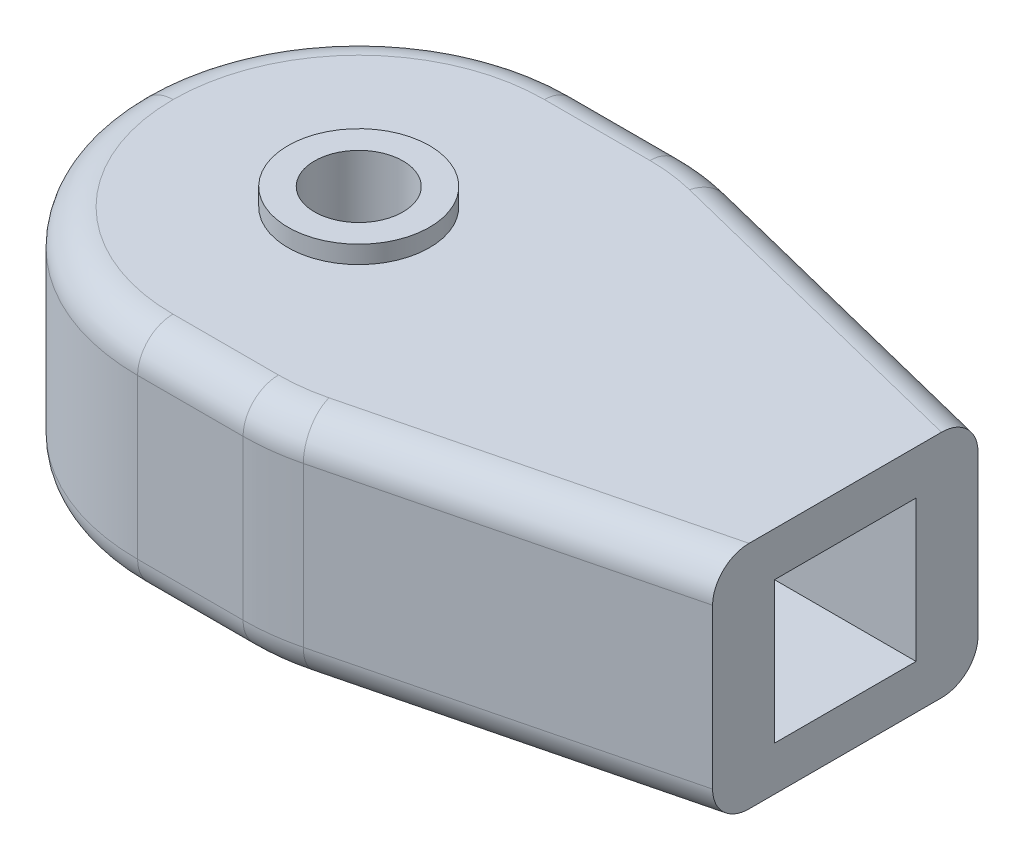
ISO-10303-21;
HEADER;
FILE_DESCRIPTION(('STEP AP214'),'2;1');
FILE_NAME('part.step','',(''),(''),'','','');
FILE_SCHEMA(('AUTOMOTIVE_DESIGN { 1 0 10303 214 1 1 1 1 }'));
ENDSEC;
DATA;
#1=APPLICATION_CONTEXT('core data for automotive mechanical design processes');
#2=APPLICATION_PROTOCOL_DEFINITION('international standard','automotive_design',2000,#1);
#3=PRODUCT_CONTEXT('',#1,'mechanical');
#4=PRODUCT('Part','Part','',(#3));
#5=PRODUCT_RELATED_PRODUCT_CATEGORY('part','',(#4));
#6=PRODUCT_DEFINITION_FORMATION('','',#4);
#7=PRODUCT_DEFINITION_CONTEXT('part definition',#1,'design');
#8=PRODUCT_DEFINITION('design','',#6,#7);
#9=PRODUCT_DEFINITION_SHAPE('','',#8);
#10=(LENGTH_UNIT() NAMED_UNIT(*) SI_UNIT(.MILLI.,.METRE.));
#11=(NAMED_UNIT(*) PLANE_ANGLE_UNIT() SI_UNIT($,.RADIAN.));
#12=(NAMED_UNIT(*) SI_UNIT($,.STERADIAN.) SOLID_ANGLE_UNIT());
#13=UNCERTAINTY_MEASURE_WITH_UNIT(LENGTH_MEASURE(1.E-05),#10,'distance_accuracy_value','');
#14=(GEOMETRIC_REPRESENTATION_CONTEXT(3) GLOBAL_UNCERTAINTY_ASSIGNED_CONTEXT((#13)) GLOBAL_UNIT_ASSIGNED_CONTEXT((#10,
#11,#12)) REPRESENTATION_CONTEXT('',''));
#15=CARTESIAN_POINT('',(0.,0.,0.));
#16=DIRECTION('',(0.,0.,1.));
#17=DIRECTION('',(1.,0.,0.));
#18=AXIS2_PLACEMENT_3D('',#15,#16,#17);
#19=CARTESIAN_POINT('',(25.,-6.5,12.5));
#20=DIRECTION('',(0.,1.,0.));
#21=DIRECTION('',(0.,0.,1.));
#22=AXIS2_PLACEMENT_3D('',#19,#20,#21);
#23=PLANE('',#22);
#24=DIRECTION('',(0.,0.,-1.));
#25=VECTOR('',#24,1.);
#26=CARTESIAN_POINT('',(65.,-6.5,12.5));
#27=LINE('',#26,#25);
#28=CARTESIAN_POINT('',(65.,-6.5,5.43844718719117));
#29=VERTEX_POINT('',#28);
#30=CARTESIAN_POINT('',(65.,-6.5,-5.43844718719117));
#31=VERTEX_POINT('',#30);
#32=EDGE_CURVE('E245',#29,#31,#27,.T.);
#33=ORIENTED_EDGE('',*,*,#32,.F.);
#34=DIRECTION('',(-0.970142500145332,0.,0.242535625036333));
#35=VECTOR('',#34,1.);
#36=CARTESIAN_POINT('',(25.6913993381626,-6.5,15.2655973526505));
#37=LINE('',#36,#35);
#38=CARTESIAN_POINT('',(46.0078037426607,-6.5,10.186496251526));
#39=VERTEX_POINT('',#38);
#40=EDGE_CURVE('E337',#29,#39,#37,.T.);
#41=ORIENTED_EDGE('',*,*,#40,.T.);
#42=CARTESIAN_POINT('',(43.4611796797792,-6.5,0.));
#43=DIRECTION('',(0.,1.,0.));
#44=DIRECTION('',(0.,0.,1.));
#45=AXIS2_PLACEMENT_3D('',#42,#43,#44);
#46=CIRCLE('',#45,10.5);
#47=CARTESIAN_POINT('',(43.4611796797792,-6.5,10.5));
#48=VERTEX_POINT('',#47);
#49=EDGE_CURVE('E61',#39,#48,#46,.F.);
#50=ORIENTED_EDGE('',*,*,#49,.T.);
#51=DIRECTION('',(1.,0.,0.));
#52=VECTOR('',#51,1.);
#53=CARTESIAN_POINT('',(37.5,-6.5,10.5));
#54=LINE('',#53,#52);
#55=CARTESIAN_POINT('',(37.5,-6.5,10.5));
#56=VERTEX_POINT('',#55);
#57=EDGE_CURVE('E334',#48,#56,#54,.F.);
#58=ORIENTED_EDGE('',*,*,#57,.T.);
#59=CARTESIAN_POINT('',(37.5,-6.5,0.));
#60=DIRECTION('',(0.,1.,0.));
#61=DIRECTION('',(0.,0.,1.));
#62=AXIS2_PLACEMENT_3D('',#59,#60,#61);
#63=CIRCLE('',#62,10.5);
#64=CARTESIAN_POINT('',(27.,-6.5,0.));
#65=VERTEX_POINT('',#64);
#66=EDGE_CURVE('E332',#56,#65,#63,.F.);
#67=ORIENTED_EDGE('',*,*,#66,.T.);
#68=CARTESIAN_POINT('',(37.5,-6.5,0.));
#69=DIRECTION('',(0.,1.,0.));
#70=DIRECTION('',(0.,0.,1.));
#71=AXIS2_PLACEMENT_3D('',#68,#69,#70);
#72=CIRCLE('',#71,10.5);
#73=CARTESIAN_POINT('',(37.5,-6.5,-10.5));
#74=VERTEX_POINT('',#73);
#75=EDGE_CURVE('E330',#65,#74,#72,.F.);
#76=ORIENTED_EDGE('',*,*,#75,.T.);
#77=DIRECTION('',(1.,0.,0.));
#78=VECTOR('',#77,1.);
#79=CARTESIAN_POINT('',(25.,-6.5,-10.5));
#80=LINE('',#79,#78);
#81=CARTESIAN_POINT('',(43.4611796797792,-6.5,-10.5));
#82=VERTEX_POINT('',#81);
#83=EDGE_CURVE('E328',#74,#82,#80,.T.);
#84=ORIENTED_EDGE('',*,*,#83,.T.);
#85=CARTESIAN_POINT('',(43.4611796797792,-6.5,0.));
#86=DIRECTION('',(0.,1.,0.));
#87=DIRECTION('',(0.,0.,1.));
#88=AXIS2_PLACEMENT_3D('',#85,#86,#87);
#89=CIRCLE('',#88,10.5);
#90=CARTESIAN_POINT('',(46.0078037426607,-6.5,-10.186496251526));
#91=VERTEX_POINT('',#90);
#92=EDGE_CURVE('E326',#82,#91,#89,.F.);
#93=ORIENTED_EDGE('',*,*,#92,.T.);
#94=DIRECTION('',(0.970142500145332,0.,0.242535625036333));
#95=VECTOR('',#94,1.);
#96=CARTESIAN_POINT('',(31.5737522793391,-6.5,-13.7950091173564));
#97=LINE('',#96,#95);
#98=EDGE_CURVE('E324',#91,#31,#97,.T.);
#99=ORIENTED_EDGE('',*,*,#98,.T.);
#100=EDGE_LOOP('',(#33,#41,#50,#58,#67,#76,#84,#93,#99));
#101=FACE_BOUND('',#100,.T.);
#102=CARTESIAN_POINT('',(37.5,-6.5,0.));
#103=DIRECTION('',(0.,1.,0.));
#104=DIRECTION('',(0.,0.,1.));
#105=AXIS2_PLACEMENT_3D('',#102,#103,#104);
#106=CIRCLE('',#105,4.00000000000001);
#107=CARTESIAN_POINT('',(37.5,-6.5,4.00000000000001));
#108=VERTEX_POINT('',#107);
#109=EDGE_CURVE('E219',#108,#108,#106,.F.);
#110=ORIENTED_EDGE('',*,*,#109,.F.);
#111=EDGE_LOOP('',(#110));
#112=FACE_BOUND('',#111,.T.);
#113=ADVANCED_FACE('F37',(#101,#112),#23,.F.);
#114=CARTESIAN_POINT('',(25.,6.5,12.5));
#115=DIRECTION('',(0.,-1.,0.));
#116=DIRECTION('',(0.,0.,-1.));
#117=AXIS2_PLACEMENT_3D('',#114,#115,#116);
#118=PLANE('',#117);
#119=CARTESIAN_POINT('',(43.4611796797792,6.5,0.));
#120=DIRECTION('',(0.,-1.,0.));
#121=DIRECTION('',(0.,0.,-1.));
#122=AXIS2_PLACEMENT_3D('',#119,#120,#121);
#123=CIRCLE('',#122,10.5);
#124=CARTESIAN_POINT('',(43.4611796797792,6.5,10.5));
#125=VERTEX_POINT('',#124);
#126=CARTESIAN_POINT('',(46.0078037426607,6.5,10.186496251526));
#127=VERTEX_POINT('',#126);
#128=EDGE_CURVE('E283',#125,#127,#123,.F.);
#129=ORIENTED_EDGE('',*,*,#128,.T.);
#130=DIRECTION('',(0.970142500145332,0.,-0.242535625036333));
#131=VECTOR('',#130,1.);
#132=CARTESIAN_POINT('',(25.6913993381626,6.5,15.2655973526505));
#133=LINE('',#132,#131);
#134=CARTESIAN_POINT('',(65.,6.5,5.43844718719117));
#135=VERTEX_POINT('',#134);
#136=EDGE_CURVE('E285',#127,#135,#133,.T.);
#137=ORIENTED_EDGE('',*,*,#136,.T.);
#138=DIRECTION('',(0.,0.,-1.));
#139=VECTOR('',#138,1.);
#140=CARTESIAN_POINT('',(65.,6.5,12.5));
#141=LINE('',#140,#139);
#142=CARTESIAN_POINT('',(65.,6.5,-5.43844718719117));
#143=VERTEX_POINT('',#142);
#144=EDGE_CURVE('E242',#135,#143,#141,.T.);
#145=ORIENTED_EDGE('',*,*,#144,.T.);
#146=DIRECTION('',(-0.970142500145332,0.,-0.242535625036333));
#147=VECTOR('',#146,1.);
#148=CARTESIAN_POINT('',(31.5737522793391,6.5,-13.7950091173564));
#149=LINE('',#148,#147);
#150=CARTESIAN_POINT('',(46.0078037426607,6.5,-10.186496251526));
#151=VERTEX_POINT('',#150);
#152=EDGE_CURVE('E271',#143,#151,#149,.T.);
#153=ORIENTED_EDGE('',*,*,#152,.T.);
#154=CARTESIAN_POINT('',(43.4611796797792,6.5,0.));
#155=DIRECTION('',(0.,-1.,0.));
#156=DIRECTION('',(0.,0.,-1.));
#157=AXIS2_PLACEMENT_3D('',#154,#155,#156);
#158=CIRCLE('',#157,10.5);
#159=CARTESIAN_POINT('',(43.4611796797792,6.5,-10.5));
#160=VERTEX_POINT('',#159);
#161=EDGE_CURVE('E273',#151,#160,#158,.F.);
#162=ORIENTED_EDGE('',*,*,#161,.T.);
#163=DIRECTION('',(-1.,0.,0.));
#164=VECTOR('',#163,1.);
#165=CARTESIAN_POINT('',(25.,6.5,-10.5));
#166=LINE('',#165,#164);
#167=CARTESIAN_POINT('',(37.5,6.5,-10.5));
#168=VERTEX_POINT('',#167);
#169=EDGE_CURVE('E275',#160,#168,#166,.T.);
#170=ORIENTED_EDGE('',*,*,#169,.T.);
#171=CARTESIAN_POINT('',(37.5,6.5,0.));
#172=DIRECTION('',(0.,-1.,0.));
#173=DIRECTION('',(0.,0.,-1.));
#174=AXIS2_PLACEMENT_3D('',#171,#172,#173);
#175=CIRCLE('',#174,10.5);
#176=CARTESIAN_POINT('',(27.,6.5,0.));
#177=VERTEX_POINT('',#176);
#178=EDGE_CURVE('E277',#168,#177,#175,.F.);
#179=ORIENTED_EDGE('',*,*,#178,.T.);
#180=CARTESIAN_POINT('',(37.5,6.5,0.));
#181=DIRECTION('',(0.,-1.,0.));
#182=DIRECTION('',(0.,0.,-1.));
#183=AXIS2_PLACEMENT_3D('',#180,#181,#182);
#184=CIRCLE('',#183,10.5);
#185=CARTESIAN_POINT('',(37.5,6.5,10.5));
#186=VERTEX_POINT('',#185);
#187=EDGE_CURVE('E279',#177,#186,#184,.F.);
#188=ORIENTED_EDGE('',*,*,#187,.T.);
#189=DIRECTION('',(-1.,0.,0.));
#190=VECTOR('',#189,1.);
#191=CARTESIAN_POINT('',(43.4611796797792,6.5,10.5));
#192=LINE('',#191,#190);
#193=EDGE_CURVE('E281',#186,#125,#192,.F.);
#194=ORIENTED_EDGE('',*,*,#193,.T.);
#195=EDGE_LOOP('',(#129,#137,#145,#153,#162,#170,#179,#188,#194));
#196=FACE_BOUND('',#195,.T.);
#197=CARTESIAN_POINT('',(37.5,6.5,0.));
#198=DIRECTION('',(0.,-1.,0.));
#199=DIRECTION('',(0.,0.,-1.));
#200=AXIS2_PLACEMENT_3D('',#197,#198,#199);
#201=CIRCLE('',#200,4.00000000000001);
#202=CARTESIAN_POINT('',(37.5,6.5,-4.00000000000001));
#203=VERTEX_POINT('',#202);
#204=EDGE_CURVE('E254',#203,#203,#201,.F.);
#205=ORIENTED_EDGE('',*,*,#204,.F.);
#206=EDGE_LOOP('',(#205));
#207=FACE_BOUND('',#206,.T.);
#208=ADVANCED_FACE('F440',(#196,#207),#118,.F.);
#209=CARTESIAN_POINT('',(65.,6.5,12.5));
#210=DIRECTION('',(-1.,0.,0.));
#211=DIRECTION('',(0.,0.,1.));
#212=AXIS2_PLACEMENT_3D('',#209,#210,#211);
#213=PLANE('',#212);
#214=DIRECTION('',(0.,0.,-1.));
#215=VECTOR('',#214,1.);
#216=CARTESIAN_POINT('',(65.,-4.,-4.));
#217=LINE('',#216,#215);
#218=CARTESIAN_POINT('',(65.,-4.,4.));
#219=VERTEX_POINT('',#218);
#220=CARTESIAN_POINT('',(65.,-4.,-4.));
#221=VERTEX_POINT('',#220);
#222=EDGE_CURVE('E225',#219,#221,#217,.T.);
#223=ORIENTED_EDGE('',*,*,#222,.F.);
#224=DIRECTION('',(0.,-1.,0.));
#225=VECTOR('',#224,1.);
#226=CARTESIAN_POINT('',(65.,-4.,4.));
#227=LINE('',#226,#225);
#228=CARTESIAN_POINT('',(65.,4.,4.));
#229=VERTEX_POINT('',#228);
#230=EDGE_CURVE('E196',#229,#219,#227,.T.);
#231=ORIENTED_EDGE('',*,*,#230,.F.);
#232=DIRECTION('',(0.,0.,1.));
#233=VECTOR('',#232,1.);
#234=CARTESIAN_POINT('',(65.,4.,-4.));
#235=LINE('',#234,#233);
#236=CARTESIAN_POINT('',(65.,4.,-4.));
#237=VERTEX_POINT('',#236);
#238=EDGE_CURVE('E213',#237,#229,#235,.T.);
#239=ORIENTED_EDGE('',*,*,#238,.F.);
#240=DIRECTION('',(0.,1.,0.));
#241=VECTOR('',#240,1.);
#242=CARTESIAN_POINT('',(65.,-4.,-4.));
#243=LINE('',#242,#241);
#244=EDGE_CURVE('E216',#221,#237,#243,.T.);
#245=ORIENTED_EDGE('',*,*,#244,.F.);
#246=EDGE_LOOP('',(#223,#231,#239,#245));
#247=FACE_BOUND('',#246,.T.);
#248=ORIENTED_EDGE('',*,*,#144,.F.);
#249=CARTESIAN_POINT('',(65.,4.5,5.43844718719117));
#250=DIRECTION('',(-1.,0.,0.));
#251=DIRECTION('',(0.,0.,-1.));
#252=AXIS2_PLACEMENT_3D('',#249,#250,#251);
#253=ELLIPSE('',#252,2.06155281280883,2.);
#254=CARTESIAN_POINT('',(65.,4.5,7.5));
#255=VERTEX_POINT('',#254);
#256=EDGE_CURVE('E294',#135,#255,#253,.F.);
#257=ORIENTED_EDGE('',*,*,#256,.T.);
#258=DIRECTION('',(0.,1.,0.));
#259=VECTOR('',#258,1.);
#260=CARTESIAN_POINT('',(65.,-13.5,7.5));
#261=LINE('',#260,#259);
#262=CARTESIAN_POINT('',(65.,-4.5,7.5));
#263=VERTEX_POINT('',#262);
#264=EDGE_CURVE('E232',#263,#255,#261,.T.);
#265=ORIENTED_EDGE('',*,*,#264,.F.);
#266=CARTESIAN_POINT('',(65.,-4.5,5.43844718719117));
#267=DIRECTION('',(-1.,0.,0.));
#268=DIRECTION('',(0.,0.,1.));
#269=AXIS2_PLACEMENT_3D('',#266,#267,#268);
#270=ELLIPSE('',#269,2.06155281280883,2.);
#271=EDGE_CURVE('E292',#263,#29,#270,.F.);
#272=ORIENTED_EDGE('',*,*,#271,.T.);
#273=ORIENTED_EDGE('',*,*,#32,.T.);
#274=CARTESIAN_POINT('',(65.,-4.5,-5.43844718719117));
#275=DIRECTION('',(-1.,0.,0.));
#276=DIRECTION('',(0.,0.,1.));
#277=AXIS2_PLACEMENT_3D('',#274,#275,#276);
#278=ELLIPSE('',#277,2.06155281280883,2.);
#279=CARTESIAN_POINT('',(65.,-4.5,-7.5));
#280=VERTEX_POINT('',#279);
#281=EDGE_CURVE('E288',#31,#280,#278,.F.);
#282=ORIENTED_EDGE('',*,*,#281,.T.);
#283=DIRECTION('',(0.,1.,0.));
#284=VECTOR('',#283,1.);
#285=CARTESIAN_POINT('',(65.,-13.5,-7.5));
#286=LINE('',#285,#284);
#287=CARTESIAN_POINT('',(65.,4.5,-7.5));
#288=VERTEX_POINT('',#287);
#289=EDGE_CURVE('E236',#280,#288,#286,.T.);
#290=ORIENTED_EDGE('',*,*,#289,.T.);
#291=CARTESIAN_POINT('',(65.,4.5,-5.43844718719117));
#292=DIRECTION('',(-1.,0.,0.));
#293=DIRECTION('',(0.,0.,-1.));
#294=AXIS2_PLACEMENT_3D('',#291,#292,#293);
#295=ELLIPSE('',#294,2.06155281280883,2.);
#296=EDGE_CURVE('E290',#288,#143,#295,.F.);
#297=ORIENTED_EDGE('',*,*,#296,.T.);
#298=EDGE_LOOP('',(#248,#257,#265,#272,#273,#282,#290,#297));
#299=FACE_BOUND('',#298,.T.);
#300=ADVANCED_FACE('F394',(#247,#299),#213,.F.);
#301=CARTESIAN_POINT('',(0.,0.,12.5));
#302=DIRECTION('',(0.,0.,1.));
#303=DIRECTION('',(1.,0.,0.));
#304=AXIS2_PLACEMENT_3D('',#301,#302,#303);
#305=PLANE('',#304);
#306=DIRECTION('',(0.,-1.,0.));
#307=VECTOR('',#306,1.);
#308=CARTESIAN_POINT('',(43.4611796797792,6.5,12.5));
#309=LINE('',#308,#307);
#310=CARTESIAN_POINT('',(43.4611796797792,-4.5,12.5));
#311=VERTEX_POINT('',#310);
#312=CARTESIAN_POINT('',(43.4611796797792,4.5,12.5));
#313=VERTEX_POINT('',#312);
#314=EDGE_CURVE('E262',#311,#313,#309,.F.);
#315=ORIENTED_EDGE('',*,*,#314,.T.);
#316=DIRECTION('',(-1.,0.,0.));
#317=VECTOR('',#316,1.);
#318=CARTESIAN_POINT('',(37.5,4.5,12.5));
#319=LINE('',#318,#317);
#320=CARTESIAN_POINT('',(37.5,4.5,12.5));
#321=VERTEX_POINT('',#320);
#322=EDGE_CURVE('E306',#313,#321,#319,.T.);
#323=ORIENTED_EDGE('',*,*,#322,.T.);
#324=DIRECTION('',(0.,-1.,0.));
#325=VECTOR('',#324,1.);
#326=CARTESIAN_POINT('',(37.5,-6.5,12.5));
#327=LINE('',#326,#325);
#328=CARTESIAN_POINT('',(37.5,-4.5,12.5));
#329=VERTEX_POINT('',#328);
#330=EDGE_CURVE('E248',#321,#329,#327,.T.);
#331=ORIENTED_EDGE('',*,*,#330,.T.);
#332=DIRECTION('',(1.,0.,0.));
#333=VECTOR('',#332,1.);
#334=CARTESIAN_POINT('',(43.4611796797792,-4.5,12.5));
#335=LINE('',#334,#333);
#336=EDGE_CURVE('E304',#329,#311,#335,.T.);
#337=ORIENTED_EDGE('',*,*,#336,.T.);
#338=EDGE_LOOP('',(#315,#323,#331,#337));
#339=FACE_BOUND('',#338,.T.);
#340=ADVANCED_FACE('F481',(#339),#305,.T.);
#341=CARTESIAN_POINT('',(0.,0.,-12.5));
#342=DIRECTION('',(0.,0.,1.));
#343=DIRECTION('',(1.,0.,0.));
#344=AXIS2_PLACEMENT_3D('',#341,#342,#343);
#345=PLANE('',#344);
#346=DIRECTION('',(0.,-1.,0.));
#347=VECTOR('',#346,1.);
#348=CARTESIAN_POINT('',(37.5,0.,-12.5));
#349=LINE('',#348,#347);
#350=CARTESIAN_POINT('',(37.5,-4.5,-12.5));
#351=VERTEX_POINT('',#350);
#352=CARTESIAN_POINT('',(37.5,4.5,-12.5));
#353=VERTEX_POINT('',#352);
#354=EDGE_CURVE('E251',#351,#353,#349,.F.);
#355=ORIENTED_EDGE('',*,*,#354,.T.);
#356=DIRECTION('',(-1.,0.,0.));
#357=VECTOR('',#356,1.);
#358=CARTESIAN_POINT('',(0.,4.5,-12.5));
#359=LINE('',#358,#357);
#360=CARTESIAN_POINT('',(43.4611796797792,4.5,-12.5));
#361=VERTEX_POINT('',#360);
#362=EDGE_CURVE('E318',#353,#361,#359,.F.);
#363=ORIENTED_EDGE('',*,*,#362,.T.);
#364=DIRECTION('',(0.,-1.,0.));
#365=VECTOR('',#364,1.);
#366=CARTESIAN_POINT('',(43.4611796797792,0.,-12.5));
#367=LINE('',#366,#365);
#368=CARTESIAN_POINT('',(43.4611796797792,-4.5,-12.5));
#369=VERTEX_POINT('',#368);
#370=EDGE_CURVE('E265',#361,#369,#367,.T.);
#371=ORIENTED_EDGE('',*,*,#370,.T.);
#372=DIRECTION('',(1.,0.,0.));
#373=VECTOR('',#372,1.);
#374=CARTESIAN_POINT('',(0.,-4.5,-12.5));
#375=LINE('',#374,#373);
#376=EDGE_CURVE('E316',#369,#351,#375,.F.);
#377=ORIENTED_EDGE('',*,*,#376,.T.);
#378=EDGE_LOOP('',(#355,#363,#371,#377));
#379=FACE_BOUND('',#378,.T.);
#380=ADVANCED_FACE('F421',(#379),#345,.F.);
#381=CARTESIAN_POINT('',(37.5,6.5,0.));
#382=DIRECTION('',(0.,-1.,0.));
#383=DIRECTION('',(0.,0.,-1.));
#384=AXIS2_PLACEMENT_3D('',#381,#382,#383);
#385=CYLINDRICAL_SURFACE('',#384,12.5);
#386=DIRECTION('',(0.,-1.,0.));
#387=VECTOR('',#386,1.);
#388=CARTESIAN_POINT('',(25.,6.5,0.));
#389=LINE('',#388,#387);
#390=CARTESIAN_POINT('',(25.,4.5,0.));
#391=VERTEX_POINT('',#390);
#392=CARTESIAN_POINT('',(25.,-4.5,0.));
#393=VERTEX_POINT('',#392);
#394=EDGE_CURVE('E239',#391,#393,#389,.T.);
#395=ORIENTED_EDGE('',*,*,#394,.F.);
#396=CARTESIAN_POINT('',(37.5,4.5,0.));
#397=DIRECTION('',(0.,-1.,0.));
#398=DIRECTION('',(0.,0.,-1.));
#399=AXIS2_PLACEMENT_3D('',#396,#397,#398);
#400=CIRCLE('',#399,12.5);
#401=EDGE_CURVE('E314',#391,#353,#400,.T.);
#402=ORIENTED_EDGE('',*,*,#401,.T.);
#403=ORIENTED_EDGE('',*,*,#354,.F.);
#404=CARTESIAN_POINT('',(37.5,-4.5,0.));
#405=DIRECTION('',(0.,1.,0.));
#406=DIRECTION('',(0.,0.,1.));
#407=AXIS2_PLACEMENT_3D('',#404,#405,#406);
#408=CIRCLE('',#407,12.5);
#409=EDGE_CURVE('E312',#351,#393,#408,.T.);
#410=ORIENTED_EDGE('',*,*,#409,.T.);
#411=EDGE_LOOP('',(#395,#402,#403,#410));
#412=FACE_BOUND('',#411,.T.);
#413=ADVANCED_FACE('F426',(#412),#385,.T.);
#414=CARTESIAN_POINT('',(37.5,0.,0.));
#415=DIRECTION('',(0.,1.,0.));
#416=DIRECTION('',(0.,0.,1.));
#417=AXIS2_PLACEMENT_3D('',#414,#415,#416);
#418=CYLINDRICAL_SURFACE('',#417,12.5);
#419=ORIENTED_EDGE('',*,*,#330,.F.);
#420=CARTESIAN_POINT('',(37.5,4.5,0.));
#421=DIRECTION('',(0.,-1.,0.));
#422=DIRECTION('',(0.,0.,-1.));
#423=AXIS2_PLACEMENT_3D('',#420,#421,#422);
#424=CIRCLE('',#423,12.5);
#425=EDGE_CURVE('E310',#321,#391,#424,.T.);
#426=ORIENTED_EDGE('',*,*,#425,.T.);
#427=ORIENTED_EDGE('',*,*,#394,.T.);
#428=CARTESIAN_POINT('',(37.5,-4.5,0.));
#429=DIRECTION('',(0.,1.,0.));
#430=DIRECTION('',(0.,0.,1.));
#431=AXIS2_PLACEMENT_3D('',#428,#429,#430);
#432=CIRCLE('',#431,12.5);
#433=EDGE_CURVE('E308',#393,#329,#432,.T.);
#434=ORIENTED_EDGE('',*,*,#433,.T.);
#435=EDGE_LOOP('',(#419,#426,#427,#434));
#436=FACE_BOUND('',#435,.T.);
#437=ADVANCED_FACE('F483',(#436),#418,.T.);
#438=CARTESIAN_POINT('',(45.,-13.5,-12.5));
#439=DIRECTION('',(-0.242535625036333,0.,0.970142500145332));
#440=DIRECTION('',(0.970142500145332,0.,0.242535625036333));
#441=AXIS2_PLACEMENT_3D('',#438,#439,#440);
#442=PLANE('',#441);
#443=DIRECTION('',(0.,-1.,0.));
#444=VECTOR('',#443,1.);
#445=CARTESIAN_POINT('',(46.4928749927334,-13.5,-12.1267812518167));
#446=LINE('',#445,#444);
#447=CARTESIAN_POINT('',(46.4928749927334,-4.5,-12.1267812518167));
#448=VERTEX_POINT('',#447);
#449=CARTESIAN_POINT('',(46.4928749927334,4.5,-12.1267812518167));
#450=VERTEX_POINT('',#449);
#451=EDGE_CURVE('E268',#448,#450,#446,.F.);
#452=ORIENTED_EDGE('',*,*,#451,.T.);
#453=DIRECTION('',(-0.970142500145332,0.,-0.242535625036333));
#454=VECTOR('',#453,1.);
#455=CARTESIAN_POINT('',(45.,4.5,-12.5));
#456=LINE('',#455,#454);
#457=EDGE_CURVE('E11',#450,#288,#456,.F.);
#458=ORIENTED_EDGE('',*,*,#457,.T.);
#459=ORIENTED_EDGE('',*,*,#289,.F.);
#460=DIRECTION('',(0.970142500145332,0.,0.242535625036333));
#461=VECTOR('',#460,1.);
#462=CARTESIAN_POINT('',(45.,-4.5,-12.5));
#463=LINE('',#462,#461);
#464=EDGE_CURVE('E46',#280,#448,#463,.F.);
#465=ORIENTED_EDGE('',*,*,#464,.T.);
#466=EDGE_LOOP('',(#452,#458,#459,#465));
#467=FACE_BOUND('',#466,.T.);
#468=ADVANCED_FACE('F461',(#467),#442,.F.);
#469=CARTESIAN_POINT('',(45.,-13.5,12.5));
#470=DIRECTION('',(-0.242535625036333,0.,-0.970142500145332));
#471=DIRECTION('',(-0.970142500145332,0.,0.242535625036333));
#472=AXIS2_PLACEMENT_3D('',#469,#470,#471);
#473=PLANE('',#472);
#474=ORIENTED_EDGE('',*,*,#264,.T.);
#475=DIRECTION('',(0.970142500145332,0.,-0.242535625036333));
#476=VECTOR('',#475,1.);
#477=CARTESIAN_POINT('',(45.,4.5,12.5));
#478=LINE('',#477,#476);
#479=CARTESIAN_POINT('',(46.4928749927334,4.5,12.1267812518167));
#480=VERTEX_POINT('',#479);
#481=EDGE_CURVE('E298',#255,#480,#478,.F.);
#482=ORIENTED_EDGE('',*,*,#481,.T.);
#483=DIRECTION('',(0.,-1.,0.));
#484=VECTOR('',#483,1.);
#485=CARTESIAN_POINT('',(46.4928749927334,-6.5,12.1267812518167));
#486=LINE('',#485,#484);
#487=CARTESIAN_POINT('',(46.4928749927334,-4.5,12.1267812518167));
#488=VERTEX_POINT('',#487);
#489=EDGE_CURVE('E259',#480,#488,#486,.T.);
#490=ORIENTED_EDGE('',*,*,#489,.T.);
#491=DIRECTION('',(-0.970142500145332,0.,0.242535625036333));
#492=VECTOR('',#491,1.);
#493=CARTESIAN_POINT('',(45.,-4.5,12.5));
#494=LINE('',#493,#492);
#495=EDGE_CURVE('E296',#488,#263,#494,.F.);
#496=ORIENTED_EDGE('',*,*,#495,.T.);
#497=EDGE_LOOP('',(#474,#482,#490,#496));
#498=FACE_BOUND('',#497,.T.);
#499=ADVANCED_FACE('F468',(#498),#473,.F.);
#500=CARTESIAN_POINT('',(45.,-4.,4.));
#501=DIRECTION('',(0.,0.,1.));
#502=DIRECTION('',(1.,0.,0.));
#503=AXIS2_PLACEMENT_3D('',#500,#501,#502);
#504=PLANE('',#503);
#505=ORIENTED_EDGE('',*,*,#230,.T.);
#506=DIRECTION('',(1.,0.,0.));
#507=VECTOR('',#506,1.);
#508=CARTESIAN_POINT('',(45.,-4.,4.));
#509=LINE('',#508,#507);
#510=CARTESIAN_POINT('',(45.,-4.,4.));
#511=VERTEX_POINT('',#510);
#512=EDGE_CURVE('E189',#511,#219,#509,.T.);
#513=ORIENTED_EDGE('',*,*,#512,.F.);
#514=DIRECTION('',(0.,-1.,0.));
#515=VECTOR('',#514,1.);
#516=CARTESIAN_POINT('',(45.,-4.,4.));
#517=LINE('',#516,#515);
#518=CARTESIAN_POINT('',(45.,4.,4.));
#519=VERTEX_POINT('',#518);
#520=EDGE_CURVE('E193',#519,#511,#517,.T.);
#521=ORIENTED_EDGE('',*,*,#520,.F.);
#522=DIRECTION('',(1.,0.,0.));
#523=VECTOR('',#522,1.);
#524=CARTESIAN_POINT('',(45.,4.,4.));
#525=LINE('',#524,#523);
#526=EDGE_CURVE('E230',#519,#229,#525,.T.);
#527=ORIENTED_EDGE('',*,*,#526,.T.);
#528=EDGE_LOOP('',(#505,#513,#521,#527));
#529=FACE_BOUND('',#528,.T.);
#530=ADVANCED_FACE('F191',(#529),#504,.F.);
#531=CARTESIAN_POINT('',(45.,4.,-4.));
#532=DIRECTION('',(0.,1.,0.));
#533=DIRECTION('',(0.,0.,1.));
#534=AXIS2_PLACEMENT_3D('',#531,#532,#533);
#535=PLANE('',#534);
#536=ORIENTED_EDGE('',*,*,#238,.T.);
#537=ORIENTED_EDGE('',*,*,#526,.F.);
#538=DIRECTION('',(0.,0.,1.));
#539=VECTOR('',#538,1.);
#540=CARTESIAN_POINT('',(45.,4.,-4.));
#541=LINE('',#540,#539);
#542=CARTESIAN_POINT('',(45.,4.,-4.));
#543=VERTEX_POINT('',#542);
#544=EDGE_CURVE('E201',#543,#519,#541,.T.);
#545=ORIENTED_EDGE('',*,*,#544,.F.);
#546=DIRECTION('',(1.,0.,0.));
#547=VECTOR('',#546,1.);
#548=CARTESIAN_POINT('',(45.,4.,-4.));
#549=LINE('',#548,#547);
#550=EDGE_CURVE('E233',#543,#237,#549,.T.);
#551=ORIENTED_EDGE('',*,*,#550,.T.);
#552=EDGE_LOOP('',(#536,#537,#545,#551));
#553=FACE_BOUND('',#552,.T.);
#554=ADVANCED_FACE('F516',(#553),#535,.F.);
#555=CARTESIAN_POINT('',(45.,-4.,-4.));
#556=DIRECTION('',(0.,0.,-1.));
#557=DIRECTION('',(-1.,0.,0.));
#558=AXIS2_PLACEMENT_3D('',#555,#556,#557);
#559=PLANE('',#558);
#560=ORIENTED_EDGE('',*,*,#244,.T.);
#561=ORIENTED_EDGE('',*,*,#550,.F.);
#562=DIRECTION('',(0.,1.,0.));
#563=VECTOR('',#562,1.);
#564=CARTESIAN_POINT('',(45.,-4.,-4.));
#565=LINE('',#564,#563);
#566=CARTESIAN_POINT('',(45.,-4.,-4.));
#567=VERTEX_POINT('',#566);
#568=EDGE_CURVE('E209',#567,#543,#565,.T.);
#569=ORIENTED_EDGE('',*,*,#568,.F.);
#570=DIRECTION('',(1.,0.,0.));
#571=VECTOR('',#570,1.);
#572=CARTESIAN_POINT('',(45.,-4.,-4.));
#573=LINE('',#572,#571);
#574=EDGE_CURVE('E200',#567,#221,#573,.T.);
#575=ORIENTED_EDGE('',*,*,#574,.T.);
#576=EDGE_LOOP('',(#560,#561,#569,#575));
#577=FACE_BOUND('',#576,.T.);
#578=ADVANCED_FACE('F519',(#577),#559,.F.);
#579=CARTESIAN_POINT('',(45.,-4.,-4.));
#580=DIRECTION('',(0.,-1.,0.));
#581=DIRECTION('',(0.,0.,-1.));
#582=AXIS2_PLACEMENT_3D('',#579,#580,#581);
#583=PLANE('',#582);
#584=ORIENTED_EDGE('',*,*,#222,.T.);
#585=ORIENTED_EDGE('',*,*,#574,.F.);
#586=DIRECTION('',(0.,0.,-1.));
#587=VECTOR('',#586,1.);
#588=CARTESIAN_POINT('',(45.,-4.,-4.));
#589=LINE('',#588,#587);
#590=EDGE_CURVE('E204',#511,#567,#589,.T.);
#591=ORIENTED_EDGE('',*,*,#590,.F.);
#592=ORIENTED_EDGE('',*,*,#512,.T.);
#593=EDGE_LOOP('',(#584,#585,#591,#592));
#594=FACE_BOUND('',#593,.T.);
#595=ADVANCED_FACE('F205',(#594),#583,.F.);
#596=CARTESIAN_POINT('',(45.,0.,0.));
#597=DIRECTION('',(1.,0.,0.));
#598=DIRECTION('',(0.,0.,-1.));
#599=AXIS2_PLACEMENT_3D('',#596,#597,#598);
#600=PLANE('',#599);
#601=ORIENTED_EDGE('',*,*,#520,.T.);
#602=ORIENTED_EDGE('',*,*,#590,.T.);
#603=ORIENTED_EDGE('',*,*,#568,.T.);
#604=ORIENTED_EDGE('',*,*,#544,.T.);
#605=EDGE_LOOP('',(#601,#602,#603,#604));
#606=FACE_BOUND('',#605,.T.);
#607=ADVANCED_FACE('F211',(#606),#600,.T.);
#608=CARTESIAN_POINT('',(37.5,-7.5,0.));
#609=DIRECTION('',(0.,1.,0.));
#610=DIRECTION('',(0.,0.,1.));
#611=AXIS2_PLACEMENT_3D('',#608,#609,#610);
#612=CYLINDRICAL_SURFACE('',#611,4.00000000000001);
#613=CARTESIAN_POINT('',(37.5,7.5,0.));
#614=DIRECTION('',(0.,-1.,0.));
#615=DIRECTION('',(0.,0.,-1.));
#616=AXIS2_PLACEMENT_3D('',#613,#614,#615);
#617=CIRCLE('',#616,4.00000000000001);
#618=CARTESIAN_POINT('',(37.5,7.5,-4.00000000000001));
#619=VERTEX_POINT('',#618);
#620=EDGE_CURVE('E549',#619,#619,#617,.T.);
#621=ORIENTED_EDGE('',*,*,#620,.T.);
#622=EDGE_LOOP('',(#621));
#623=FACE_BOUND('',#622,.T.);
#624=ORIENTED_EDGE('',*,*,#204,.T.);
#625=EDGE_LOOP('',(#624));
#626=FACE_BOUND('',#625,.T.);
#627=ADVANCED_FACE('F528',(#623,#626),#612,.T.);
#628=CARTESIAN_POINT('',(37.5,7.5,0.));
#629=DIRECTION('',(0.,-1.,0.));
#630=DIRECTION('',(0.,0.,-1.));
#631=AXIS2_PLACEMENT_3D('',#628,#629,#630);
#632=PLANE('',#631);
#633=ORIENTED_EDGE('',*,*,#620,.F.);
#634=EDGE_LOOP('',(#633));
#635=FACE_BOUND('',#634,.T.);
#636=CARTESIAN_POINT('',(37.5,7.5,0.));
#637=DIRECTION('',(0.,-1.,0.));
#638=DIRECTION('',(0.,0.,-1.));
#639=AXIS2_PLACEMENT_3D('',#636,#637,#638);
#640=CIRCLE('',#639,2.5);
#641=CARTESIAN_POINT('',(37.5,7.5,-2.5));
#642=VERTEX_POINT('',#641);
#643=EDGE_CURVE('E361',#642,#642,#640,.T.);
#644=ORIENTED_EDGE('',*,*,#643,.T.);
#645=EDGE_LOOP('',(#644));
#646=FACE_BOUND('',#645,.T.);
#647=ADVANCED_FACE('F512',(#635,#646),#632,.F.);
#648=CARTESIAN_POINT('',(37.5,-13.5,0.));
#649=DIRECTION('',(0.,1.,0.));
#650=DIRECTION('',(0.,0.,1.));
#651=AXIS2_PLACEMENT_3D('',#648,#649,#650);
#652=CYLINDRICAL_SURFACE('',#651,2.5);
#653=ORIENTED_EDGE('',*,*,#643,.F.);
#654=EDGE_LOOP('',(#653));
#655=FACE_BOUND('',#654,.T.);
#656=CARTESIAN_POINT('',(37.5,-7.5,0.));
#657=DIRECTION('',(0.,-1.,0.));
#658=DIRECTION('',(0.,0.,-1.));
#659=AXIS2_PLACEMENT_3D('',#656,#657,#658);
#660=CIRCLE('',#659,2.5);
#661=CARTESIAN_POINT('',(37.5,-7.5,-2.5));
#662=VERTEX_POINT('',#661);
#663=EDGE_CURVE('E547',#662,#662,#660,.T.);
#664=ORIENTED_EDGE('',*,*,#663,.T.);
#665=EDGE_LOOP('',(#664));
#666=FACE_BOUND('',#665,.T.);
#667=ADVANCED_FACE('F508',(#655,#666),#652,.F.);
#668=CARTESIAN_POINT('',(37.5,-7.5,0.));
#669=DIRECTION('',(0.,-1.,0.));
#670=DIRECTION('',(0.,0.,-1.));
#671=AXIS2_PLACEMENT_3D('',#668,#669,#670);
#672=CIRCLE('',#671,4.00000000000001);
#673=CARTESIAN_POINT('',(37.5,-7.5,-4.00000000000001));
#674=VERTEX_POINT('',#673);
#675=EDGE_CURVE('E226',#674,#674,#672,.T.);
#676=ORIENTED_EDGE('',*,*,#675,.F.);
#677=EDGE_LOOP('',(#676));
#678=FACE_BOUND('',#677,.T.);
#679=ORIENTED_EDGE('',*,*,#109,.T.);
#680=EDGE_LOOP('',(#679));
#681=FACE_BOUND('',#680,.T.);
#682=ADVANCED_FACE('F511',(#678,#681),#612,.T.);
#683=CARTESIAN_POINT('',(37.5,-7.5,0.));
#684=DIRECTION('',(0.,-1.,0.));
#685=DIRECTION('',(0.,0.,-1.));
#686=AXIS2_PLACEMENT_3D('',#683,#684,#685);
#687=PLANE('',#686);
#688=ORIENTED_EDGE('',*,*,#675,.T.);
#689=EDGE_LOOP('',(#688));
#690=FACE_BOUND('',#689,.T.);
#691=ORIENTED_EDGE('',*,*,#663,.F.);
#692=EDGE_LOOP('',(#691));
#693=FACE_BOUND('',#692,.T.);
#694=ADVANCED_FACE('F531',(#690,#693),#687,.T.);
#695=CARTESIAN_POINT('',(43.4611796797792,-13.5,0.));
#696=DIRECTION('',(0.,1.,0.));
#697=DIRECTION('',(0.,0.,1.));
#698=AXIS2_PLACEMENT_3D('',#695,#696,#697);
#699=CYLINDRICAL_SURFACE('',#698,12.5);
#700=ORIENTED_EDGE('',*,*,#489,.F.);
#701=CARTESIAN_POINT('',(43.4611796797792,4.5,0.));
#702=DIRECTION('',(0.,-1.,0.));
#703=DIRECTION('',(0.,0.,-1.));
#704=AXIS2_PLACEMENT_3D('',#701,#702,#703);
#705=CIRCLE('',#704,12.5);
#706=EDGE_CURVE('E302',#480,#313,#705,.T.);
#707=ORIENTED_EDGE('',*,*,#706,.T.);
#708=ORIENTED_EDGE('',*,*,#314,.F.);
#709=CARTESIAN_POINT('',(43.4611796797792,-4.5,0.));
#710=DIRECTION('',(0.,1.,0.));
#711=DIRECTION('',(0.,0.,1.));
#712=AXIS2_PLACEMENT_3D('',#709,#710,#711);
#713=CIRCLE('',#712,12.5);
#714=EDGE_CURVE('E300',#311,#488,#713,.T.);
#715=ORIENTED_EDGE('',*,*,#714,.T.);
#716=EDGE_LOOP('',(#700,#707,#708,#715));
#717=FACE_BOUND('',#716,.T.);
#718=ADVANCED_FACE('F472',(#717),#699,.T.);
#719=CARTESIAN_POINT('',(43.4611796797792,0.,0.));
#720=DIRECTION('',(0.,-1.,0.));
#721=DIRECTION('',(0.,0.,-1.));
#722=AXIS2_PLACEMENT_3D('',#719,#720,#721);
#723=CYLINDRICAL_SURFACE('',#722,12.5);
#724=ORIENTED_EDGE('',*,*,#370,.F.);
#725=CARTESIAN_POINT('',(43.4611796797792,4.5,0.));
#726=DIRECTION('',(0.,-1.,0.));
#727=DIRECTION('',(0.,0.,-1.));
#728=AXIS2_PLACEMENT_3D('',#725,#726,#727);
#729=CIRCLE('',#728,12.5);
#730=EDGE_CURVE('E322',#361,#450,#729,.T.);
#731=ORIENTED_EDGE('',*,*,#730,.T.);
#732=ORIENTED_EDGE('',*,*,#451,.F.);
#733=CARTESIAN_POINT('',(43.4611796797792,-4.5,0.));
#734=DIRECTION('',(0.,1.,0.));
#735=DIRECTION('',(0.,0.,1.));
#736=AXIS2_PLACEMENT_3D('',#733,#734,#735);
#737=CIRCLE('',#736,12.5);
#738=EDGE_CURVE('E320',#448,#369,#737,.T.);
#739=ORIENTED_EDGE('',*,*,#738,.T.);
#740=EDGE_LOOP('',(#724,#731,#732,#739));
#741=FACE_BOUND('',#740,.T.);
#742=ADVANCED_FACE('F450',(#741),#723,.T.);
#743=CARTESIAN_POINT('',(31.5737522793391,4.5,-13.7950091173564));
#744=DIRECTION('',(-0.970142500145332,0.,-0.242535625036333));
#745=DIRECTION('',(-0.242535625036333,0.,0.970142500145332));
#746=AXIS2_PLACEMENT_3D('',#743,#744,#745);
#747=CYLINDRICAL_SURFACE('',#746,2.);
#748=ORIENTED_EDGE('',*,*,#296,.F.);
#749=ORIENTED_EDGE('',*,*,#457,.F.);
#750=CARTESIAN_POINT('',(46.0078037426607,4.5,-10.186496251526));
#751=DIRECTION('',(-0.970142500145332,0.,-0.242535625036334));
#752=DIRECTION('',(-0.242535625036334,0.,0.970142500145332));
#753=AXIS2_PLACEMENT_3D('',#750,#751,#752);
#754=CIRCLE('',#753,2.);
#755=EDGE_CURVE('E358',#151,#450,#754,.T.);
#756=ORIENTED_EDGE('',*,*,#755,.F.);
#757=ORIENTED_EDGE('',*,*,#152,.F.);
#758=EDGE_LOOP('',(#748,#749,#756,#757));
#759=FACE_BOUND('',#758,.T.);
#760=ADVANCED_FACE('F459',(#759),#747,.T.);
#761=CARTESIAN_POINT('',(43.4611796797792,4.5,0.));
#762=DIRECTION('',(0.,-1.,0.));
#763=DIRECTION('',(0.,0.,-1.));
#764=AXIS2_PLACEMENT_3D('',#761,#762,#763);
#765=TOROIDAL_SURFACE('',#764,10.5,2.);
#766=ORIENTED_EDGE('',*,*,#755,.T.);
#767=ORIENTED_EDGE('',*,*,#730,.F.);
#768=CARTESIAN_POINT('',(43.4611796797792,4.5,-10.5));
#769=DIRECTION('',(-1.,0.,0.));
#770=DIRECTION('',(0.,0.,1.));
#771=AXIS2_PLACEMENT_3D('',#768,#769,#770);
#772=CIRCLE('',#771,2.);
#773=EDGE_CURVE('E355',#160,#361,#772,.T.);
#774=ORIENTED_EDGE('',*,*,#773,.F.);
#775=ORIENTED_EDGE('',*,*,#161,.F.);
#776=EDGE_LOOP('',(#766,#767,#774,#775));
#777=FACE_BOUND('',#776,.T.);
#778=ADVANCED_FACE('F453',(#777),#765,.T.);
#779=CARTESIAN_POINT('',(25.,4.5,-10.5));
#780=DIRECTION('',(-1.,0.,0.));
#781=DIRECTION('',(0.,0.,1.));
#782=AXIS2_PLACEMENT_3D('',#779,#780,#781);
#783=CYLINDRICAL_SURFACE('',#782,2.);
#784=ORIENTED_EDGE('',*,*,#773,.T.);
#785=ORIENTED_EDGE('',*,*,#362,.F.);
#786=CARTESIAN_POINT('',(37.5,4.5,-10.5));
#787=DIRECTION('',(-1.,0.,0.));
#788=DIRECTION('',(0.,0.,1.));
#789=AXIS2_PLACEMENT_3D('',#786,#787,#788);
#790=CIRCLE('',#789,2.);
#791=EDGE_CURVE('E352',#168,#353,#790,.T.);
#792=ORIENTED_EDGE('',*,*,#791,.F.);
#793=ORIENTED_EDGE('',*,*,#169,.F.);
#794=EDGE_LOOP('',(#784,#785,#792,#793));
#795=FACE_BOUND('',#794,.T.);
#796=ADVANCED_FACE('F447',(#795),#783,.T.);
#797=CARTESIAN_POINT('',(37.5,4.5,0.));
#798=DIRECTION('',(0.,-1.,0.));
#799=DIRECTION('',(0.,0.,-1.));
#800=AXIS2_PLACEMENT_3D('',#797,#798,#799);
#801=TOROIDAL_SURFACE('',#800,10.5,2.);
#802=ORIENTED_EDGE('',*,*,#791,.T.);
#803=ORIENTED_EDGE('',*,*,#401,.F.);
#804=CARTESIAN_POINT('',(27.,4.5,0.));
#805=DIRECTION('',(0.,0.,1.));
#806=DIRECTION('',(1.,0.,0.));
#807=AXIS2_PLACEMENT_3D('',#804,#805,#806);
#808=CIRCLE('',#807,2.);
#809=EDGE_CURVE('E349',#177,#391,#808,.T.);
#810=ORIENTED_EDGE('',*,*,#809,.F.);
#811=ORIENTED_EDGE('',*,*,#178,.F.);
#812=EDGE_LOOP('',(#802,#803,#810,#811));
#813=FACE_BOUND('',#812,.T.);
#814=ADVANCED_FACE('F430',(#813),#801,.T.);
#815=CARTESIAN_POINT('',(37.5,4.5,0.));
#816=DIRECTION('',(0.,-1.,0.));
#817=DIRECTION('',(0.,0.,-1.));
#818=AXIS2_PLACEMENT_3D('',#815,#816,#817);
#819=TOROIDAL_SURFACE('',#818,10.5,2.);
#820=ORIENTED_EDGE('',*,*,#809,.T.);
#821=ORIENTED_EDGE('',*,*,#425,.F.);
#822=CARTESIAN_POINT('',(37.5,4.5,10.5));
#823=DIRECTION('',(1.,0.,0.));
#824=DIRECTION('',(0.,0.,-1.));
#825=AXIS2_PLACEMENT_3D('',#822,#823,#824);
#826=CIRCLE('',#825,2.);
#827=EDGE_CURVE('E346',#186,#321,#826,.T.);
#828=ORIENTED_EDGE('',*,*,#827,.F.);
#829=ORIENTED_EDGE('',*,*,#187,.F.);
#830=EDGE_LOOP('',(#820,#821,#828,#829));
#831=FACE_BOUND('',#830,.T.);
#832=ADVANCED_FACE('F436',(#831),#819,.T.);
#833=CARTESIAN_POINT('',(0.,4.5,10.5));
#834=DIRECTION('',(1.,0.,0.));
#835=DIRECTION('',(0.,0.,-1.));
#836=AXIS2_PLACEMENT_3D('',#833,#834,#835);
#837=CYLINDRICAL_SURFACE('',#836,2.);
#838=ORIENTED_EDGE('',*,*,#827,.T.);
#839=ORIENTED_EDGE('',*,*,#322,.F.);
#840=CARTESIAN_POINT('',(43.4611796797792,4.5,10.5));
#841=DIRECTION('',(1.,0.,0.));
#842=DIRECTION('',(0.,0.,-1.));
#843=AXIS2_PLACEMENT_3D('',#840,#841,#842);
#844=CIRCLE('',#843,2.);
#845=EDGE_CURVE('E343',#125,#313,#844,.T.);
#846=ORIENTED_EDGE('',*,*,#845,.F.);
#847=ORIENTED_EDGE('',*,*,#193,.F.);
#848=EDGE_LOOP('',(#838,#839,#846,#847));
#849=FACE_BOUND('',#848,.T.);
#850=ADVANCED_FACE('F478',(#849),#837,.T.);
#851=CARTESIAN_POINT('',(43.4611796797792,4.5,0.));
#852=DIRECTION('',(0.,-1.,0.));
#853=DIRECTION('',(0.,0.,-1.));
#854=AXIS2_PLACEMENT_3D('',#851,#852,#853);
#855=TOROIDAL_SURFACE('',#854,10.5,2.);
#856=ORIENTED_EDGE('',*,*,#845,.T.);
#857=ORIENTED_EDGE('',*,*,#706,.F.);
#858=CARTESIAN_POINT('',(46.0078037426607,4.5,10.186496251526));
#859=DIRECTION('',(0.970142500145332,0.,-0.242535625036334));
#860=DIRECTION('',(-0.242535625036334,0.,-0.970142500145332));
#861=AXIS2_PLACEMENT_3D('',#858,#859,#860);
#862=CIRCLE('',#861,2.);
#863=EDGE_CURVE('E340',#127,#480,#862,.T.);
#864=ORIENTED_EDGE('',*,*,#863,.F.);
#865=ORIENTED_EDGE('',*,*,#128,.F.);
#866=EDGE_LOOP('',(#856,#857,#864,#865));
#867=FACE_BOUND('',#866,.T.);
#868=ADVANCED_FACE('F475',(#867),#855,.T.);
#869=CARTESIAN_POINT('',(25.6913993381626,4.5,15.2655973526505));
#870=DIRECTION('',(0.970142500145332,0.,-0.242535625036333));
#871=DIRECTION('',(-0.242535625036333,0.,-0.970142500145332));
#872=AXIS2_PLACEMENT_3D('',#869,#870,#871);
#873=CYLINDRICAL_SURFACE('',#872,2.);
#874=ORIENTED_EDGE('',*,*,#863,.T.);
#875=ORIENTED_EDGE('',*,*,#481,.F.);
#876=ORIENTED_EDGE('',*,*,#256,.F.);
#877=ORIENTED_EDGE('',*,*,#136,.F.);
#878=EDGE_LOOP('',(#874,#875,#876,#877));
#879=FACE_BOUND('',#878,.T.);
#880=ADVANCED_FACE('F466',(#879),#873,.T.);
#881=CARTESIAN_POINT('',(31.5737522793391,-4.5,-13.7950091173564));
#882=DIRECTION('',(0.970142500145332,0.,0.242535625036333));
#883=DIRECTION('',(0.242535625036333,0.,-0.970142500145332));
#884=AXIS2_PLACEMENT_3D('',#881,#882,#883);
#885=CYLINDRICAL_SURFACE('',#884,2.);
#886=ORIENTED_EDGE('',*,*,#281,.F.);
#887=ORIENTED_EDGE('',*,*,#98,.F.);
#888=CARTESIAN_POINT('',(46.0078037426607,-4.5,-10.186496251526));
#889=DIRECTION('',(-0.970142500145332,0.,-0.242535625036334));
#890=DIRECTION('',(-0.242535625036334,0.,0.970142500145332));
#891=AXIS2_PLACEMENT_3D('',#888,#889,#890);
#892=CIRCLE('',#891,2.);
#893=EDGE_CURVE('E41',#448,#91,#892,.T.);
#894=ORIENTED_EDGE('',*,*,#893,.F.);
#895=ORIENTED_EDGE('',*,*,#464,.F.);
#896=EDGE_LOOP('',(#886,#887,#894,#895));
#897=FACE_BOUND('',#896,.T.);
#898=ADVANCED_FACE('F39',(#897),#885,.T.);
#899=CARTESIAN_POINT('',(43.4611796797792,-4.5,0.));
#900=DIRECTION('',(0.,1.,0.));
#901=DIRECTION('',(0.,0.,1.));
#902=AXIS2_PLACEMENT_3D('',#899,#900,#901);
#903=TOROIDAL_SURFACE('',#902,10.5,2.);
#904=ORIENTED_EDGE('',*,*,#893,.T.);
#905=ORIENTED_EDGE('',*,*,#92,.F.);
#906=CARTESIAN_POINT('',(43.4611796797792,-4.5,-10.5));
#907=DIRECTION('',(-1.,0.,0.));
#908=DIRECTION('',(0.,0.,1.));
#909=AXIS2_PLACEMENT_3D('',#906,#907,#908);
#910=CIRCLE('',#909,2.);
#911=EDGE_CURVE('E374',#369,#82,#910,.T.);
#912=ORIENTED_EDGE('',*,*,#911,.F.);
#913=ORIENTED_EDGE('',*,*,#738,.F.);
#914=EDGE_LOOP('',(#904,#905,#912,#913));
#915=FACE_BOUND('',#914,.T.);
#916=ADVANCED_FACE('F385',(#915),#903,.T.);
#917=CARTESIAN_POINT('',(25.,-4.5,-10.5));
#918=DIRECTION('',(1.,0.,0.));
#919=DIRECTION('',(0.,0.,-1.));
#920=AXIS2_PLACEMENT_3D('',#917,#918,#919);
#921=CYLINDRICAL_SURFACE('',#920,2.);
#922=ORIENTED_EDGE('',*,*,#911,.T.);
#923=ORIENTED_EDGE('',*,*,#83,.F.);
#924=CARTESIAN_POINT('',(37.5,-4.5,-10.5));
#925=DIRECTION('',(-1.,0.,0.));
#926=DIRECTION('',(0.,0.,1.));
#927=AXIS2_PLACEMENT_3D('',#924,#925,#926);
#928=CIRCLE('',#927,2.);
#929=EDGE_CURVE('E372',#351,#74,#928,.T.);
#930=ORIENTED_EDGE('',*,*,#929,.F.);
#931=ORIENTED_EDGE('',*,*,#376,.F.);
#932=EDGE_LOOP('',(#922,#923,#930,#931));
#933=FACE_BOUND('',#932,.T.);
#934=ADVANCED_FACE('F418',(#933),#921,.T.);
#935=CARTESIAN_POINT('',(37.5,-4.5,0.));
#936=DIRECTION('',(0.,1.,0.));
#937=DIRECTION('',(0.,0.,1.));
#938=AXIS2_PLACEMENT_3D('',#935,#936,#937);
#939=TOROIDAL_SURFACE('',#938,10.5,2.);
#940=ORIENTED_EDGE('',*,*,#929,.T.);
#941=ORIENTED_EDGE('',*,*,#75,.F.);
#942=CARTESIAN_POINT('',(27.,-4.5,0.));
#943=DIRECTION('',(0.,0.,1.));
#944=DIRECTION('',(1.,0.,0.));
#945=AXIS2_PLACEMENT_3D('',#942,#943,#944);
#946=CIRCLE('',#945,2.);
#947=EDGE_CURVE('E369',#393,#65,#946,.T.);
#948=ORIENTED_EDGE('',*,*,#947,.F.);
#949=ORIENTED_EDGE('',*,*,#409,.F.);
#950=EDGE_LOOP('',(#940,#941,#948,#949));
#951=FACE_BOUND('',#950,.T.);
#952=ADVANCED_FACE('F416',(#951),#939,.T.);
#953=CARTESIAN_POINT('',(37.5,-4.5,0.));
#954=DIRECTION('',(0.,1.,0.));
#955=DIRECTION('',(0.,0.,1.));
#956=AXIS2_PLACEMENT_3D('',#953,#954,#955);
#957=TOROIDAL_SURFACE('',#956,10.5,2.);
#958=ORIENTED_EDGE('',*,*,#947,.T.);
#959=ORIENTED_EDGE('',*,*,#66,.F.);
#960=CARTESIAN_POINT('',(37.5,-4.5,10.5));
#961=DIRECTION('',(1.,0.,0.));
#962=DIRECTION('',(0.,0.,-1.));
#963=AXIS2_PLACEMENT_3D('',#960,#961,#962);
#964=CIRCLE('',#963,2.);
#965=EDGE_CURVE('E366',#329,#56,#964,.T.);
#966=ORIENTED_EDGE('',*,*,#965,.F.);
#967=ORIENTED_EDGE('',*,*,#433,.F.);
#968=EDGE_LOOP('',(#958,#959,#966,#967));
#969=FACE_BOUND('',#968,.T.);
#970=ADVANCED_FACE('F411',(#969),#957,.T.);
#971=CARTESIAN_POINT('',(0.,-4.5,10.5));
#972=DIRECTION('',(-1.,0.,0.));
#973=DIRECTION('',(0.,0.,1.));
#974=AXIS2_PLACEMENT_3D('',#971,#972,#973);
#975=CYLINDRICAL_SURFACE('',#974,2.);
#976=ORIENTED_EDGE('',*,*,#965,.T.);
#977=ORIENTED_EDGE('',*,*,#57,.F.);
#978=CARTESIAN_POINT('',(43.4611796797792,-4.5,10.5));
#979=DIRECTION('',(1.,0.,0.));
#980=DIRECTION('',(0.,0.,-1.));
#981=AXIS2_PLACEMENT_3D('',#978,#979,#980);
#982=CIRCLE('',#981,2.);
#983=EDGE_CURVE('E363',#311,#48,#982,.T.);
#984=ORIENTED_EDGE('',*,*,#983,.F.);
#985=ORIENTED_EDGE('',*,*,#336,.F.);
#986=EDGE_LOOP('',(#976,#977,#984,#985));
#987=FACE_BOUND('',#986,.T.);
#988=ADVANCED_FACE('F406',(#987),#975,.T.);
#989=CARTESIAN_POINT('',(43.4611796797792,-4.5,0.));
#990=DIRECTION('',(0.,1.,0.));
#991=DIRECTION('',(0.,0.,1.));
#992=AXIS2_PLACEMENT_3D('',#989,#990,#991);
#993=TOROIDAL_SURFACE('',#992,10.5,2.);
#994=ORIENTED_EDGE('',*,*,#983,.T.);
#995=ORIENTED_EDGE('',*,*,#49,.F.);
#996=CARTESIAN_POINT('',(46.0078037426607,-4.5,10.186496251526));
#997=DIRECTION('',(0.970142500145332,0.,-0.242535625036334));
#998=DIRECTION('',(-0.242535625036334,0.,-0.970142500145332));
#999=AXIS2_PLACEMENT_3D('',#996,#997,#998);
#1000=CIRCLE('',#999,2.);
#1001=EDGE_CURVE('E54',#488,#39,#1000,.T.);
#1002=ORIENTED_EDGE('',*,*,#1001,.F.);
#1003=ORIENTED_EDGE('',*,*,#714,.F.);
#1004=EDGE_LOOP('',(#994,#995,#1002,#1003));
#1005=FACE_BOUND('',#1004,.T.);
#1006=ADVANCED_FACE('F402',(#1005),#993,.T.);
#1007=CARTESIAN_POINT('',(25.6913993381626,-4.5,15.2655973526505));
#1008=DIRECTION('',(-0.970142500145332,0.,0.242535625036333));
#1009=DIRECTION('',(0.242535625036333,0.,0.970142500145332));
#1010=AXIS2_PLACEMENT_3D('',#1007,#1008,#1009);
#1011=CYLINDRICAL_SURFACE('',#1010,2.);
#1012=ORIENTED_EDGE('',*,*,#271,.F.);
#1013=ORIENTED_EDGE('',*,*,#495,.F.);
#1014=ORIENTED_EDGE('',*,*,#1001,.T.);
#1015=ORIENTED_EDGE('',*,*,#40,.F.);
#1016=EDGE_LOOP('',(#1012,#1013,#1014,#1015));
#1017=FACE_BOUND('',#1016,.T.);
#1018=ADVANCED_FACE('F398',(#1017),#1011,.T.);
#1019=CLOSED_SHELL('',(#113,#208,#300,#340,#380,#413,#437,#468,#499,#530,#554,#578,#595,#607,
#627,#647,#667,#682,#694,#718,#742,#760,#778,#796,#814,#832,#850,#868,#880,#898,#916,#934,#952,
#970,#988,#1006,#1018));
#1020=MANIFOLD_SOLID_BREP('B2',#1019);
#1021=ADVANCED_BREP_SHAPE_REPRESENTATION('',(#18,#1020),#14);
#1022=SHAPE_DEFINITION_REPRESENTATION(#9,#1021);
ENDSEC;
END-ISO-10303-21;
